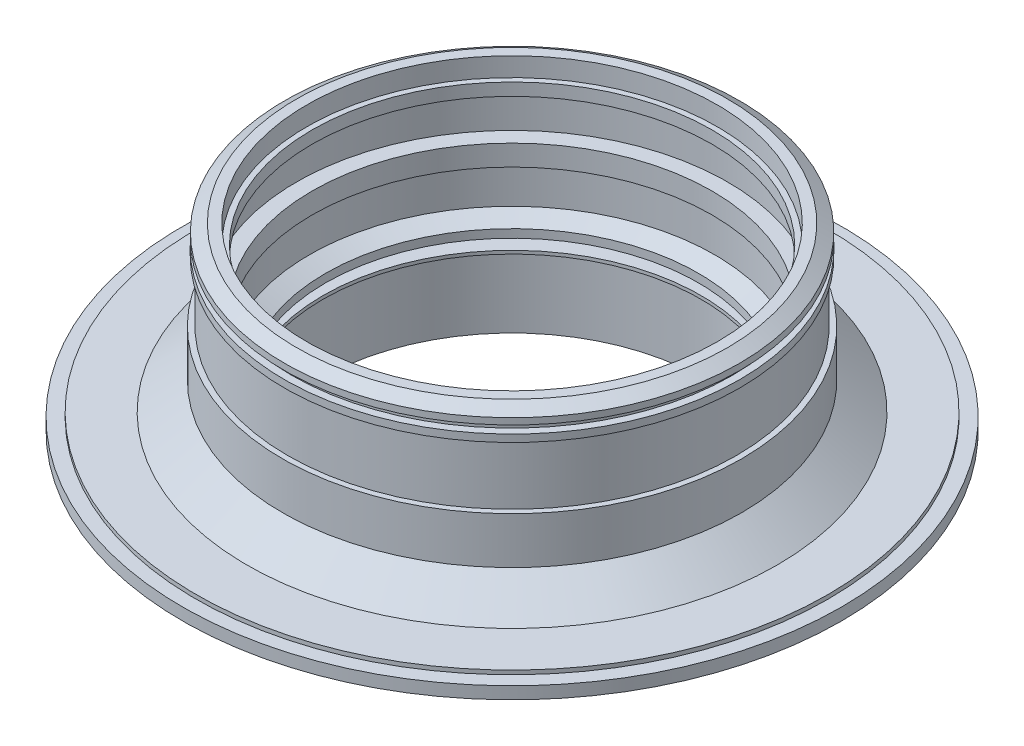
ISO-10303-21;
HEADER;
FILE_DESCRIPTION(('STEP AP214'),'2;1');
FILE_NAME('part.step','',(''),(''),'','','');
FILE_SCHEMA(('AUTOMOTIVE_DESIGN { 1 0 10303 214 1 1 1 1 }'));
ENDSEC;
DATA;
#1=APPLICATION_CONTEXT('core data for automotive mechanical design processes');
#2=APPLICATION_PROTOCOL_DEFINITION('international standard','automotive_design',2000,#1);
#3=PRODUCT_CONTEXT('',#1,'mechanical');
#4=PRODUCT('Part','Part','',(#3));
#5=PRODUCT_RELATED_PRODUCT_CATEGORY('part','',(#4));
#6=PRODUCT_DEFINITION_FORMATION('','',#4);
#7=PRODUCT_DEFINITION_CONTEXT('part definition',#1,'design');
#8=PRODUCT_DEFINITION('design','',#6,#7);
#9=PRODUCT_DEFINITION_SHAPE('','',#8);
#10=(LENGTH_UNIT() NAMED_UNIT(*) SI_UNIT(.MILLI.,.METRE.));
#11=(NAMED_UNIT(*) PLANE_ANGLE_UNIT() SI_UNIT($,.RADIAN.));
#12=(NAMED_UNIT(*) SI_UNIT($,.STERADIAN.) SOLID_ANGLE_UNIT());
#13=UNCERTAINTY_MEASURE_WITH_UNIT(LENGTH_MEASURE(1.E-05),#10,'distance_accuracy_value','');
#14=(GEOMETRIC_REPRESENTATION_CONTEXT(3) GLOBAL_UNCERTAINTY_ASSIGNED_CONTEXT((#13)) GLOBAL_UNIT_ASSIGNED_CONTEXT((#10,
#11,#12)) REPRESENTATION_CONTEXT('',''));
#15=CARTESIAN_POINT('',(0.,0.,0.));
#16=DIRECTION('',(0.,0.,1.));
#17=DIRECTION('',(1.,0.,0.));
#18=AXIS2_PLACEMENT_3D('',#15,#16,#17);
#19=CARTESIAN_POINT('',(0.,10.2104365016438,0.));
#20=DIRECTION('',(0.,-1.,0.));
#21=DIRECTION('',(1.,0.,0.));
#22=AXIS2_PLACEMENT_3D('',#19,#20,#21);
#23=CONICAL_SURFACE('',#22,85.,0.910291157041138);
#24=CARTESIAN_POINT('',(0.,3.36536354339501E-13,0.));
#25=DIRECTION('',(0.,-1.,0.));
#26=DIRECTION('',(1.,0.,0.));
#27=AXIS2_PLACEMENT_3D('',#24,#25,#26);
#28=CIRCLE('',#27,98.1422879736447);
#29=CARTESIAN_POINT('',(98.1422879736447,6.73188839409454E-13,0.));
#30=VERTEX_POINT('',#29);
#31=EDGE_CURVE('E10',#30,#30,#28,.T.);
#32=ORIENTED_EDGE('',*,*,#31,.F.);
#33=EDGE_LOOP('',(#32));
#34=FACE_BOUND('',#33,.T.);
#35=CARTESIAN_POINT('',(0.,10.2104365016438,0.));
#36=DIRECTION('',(0.,-1.,0.));
#37=DIRECTION('',(1.,0.,0.));
#38=AXIS2_PLACEMENT_3D('',#35,#36,#37);
#39=CIRCLE('',#38,85.);
#40=CARTESIAN_POINT('',(84.9999999999999,10.2104365016441,0.));
#41=VERTEX_POINT('',#40);
#42=EDGE_CURVE('E170',#41,#41,#39,.T.);
#43=ORIENTED_EDGE('',*,*,#42,.T.);
#44=EDGE_LOOP('',(#43));
#45=FACE_BOUND('',#44,.T.);
#46=ADVANCED_FACE('F37',(#34,#45),#23,.T.);
#47=CARTESIAN_POINT('',(-117.,0.,0.));
#48=DIRECTION('',(0.,-1.,0.));
#49=DIRECTION('',(1.,0.,0.));
#50=AXIS2_PLACEMENT_3D('',#47,#48,#49);
#51=PLANE('',#50);
#52=CARTESIAN_POINT('',(0.,4.02455846426619E-13,0.));
#53=DIRECTION('',(0.,-1.,0.));
#54=DIRECTION('',(1.,0.,0.));
#55=AXIS2_PLACEMENT_3D('',#52,#53,#54);
#56=CIRCLE('',#55,117.);
#57=CARTESIAN_POINT('',(117.,8.03794979296254E-13,0.));
#58=VERTEX_POINT('',#57);
#59=EDGE_CURVE('E43',#58,#58,#56,.T.);
#60=ORIENTED_EDGE('',*,*,#59,.F.);
#61=EDGE_LOOP('',(#60));
#62=FACE_BOUND('',#61,.T.);
#63=ORIENTED_EDGE('',*,*,#31,.T.);
#64=EDGE_LOOP('',(#63));
#65=FACE_BOUND('',#64,.T.);
#66=ADVANCED_FACE('F417',(#62,#65),#51,.F.);
#67=CARTESIAN_POINT('',(0.,-27.7680104879554,0.));
#68=DIRECTION('',(0.,-1.,0.));
#69=DIRECTION('',(1.,0.,0.));
#70=AXIS2_PLACEMENT_3D('',#67,#68,#69);
#71=CYLINDRICAL_SURFACE('',#70,117.);
#72=CARTESIAN_POINT('',(0.,-1.4999999999996,0.));
#73=DIRECTION('',(0.,-1.,0.));
#74=DIRECTION('',(1.,0.,0.));
#75=AXIS2_PLACEMENT_3D('',#72,#73,#74);
#76=CIRCLE('',#75,117.);
#77=CARTESIAN_POINT('',(117.,-1.4999999999992,0.));
#78=VERTEX_POINT('',#77);
#79=EDGE_CURVE('E47',#78,#78,#76,.T.);
#80=ORIENTED_EDGE('',*,*,#79,.F.);
#81=EDGE_LOOP('',(#80));
#82=FACE_BOUND('',#81,.T.);
#83=ORIENTED_EDGE('',*,*,#59,.T.);
#84=EDGE_LOOP('',(#83));
#85=FACE_BOUND('',#84,.T.);
#86=ADVANCED_FACE('F412',(#82,#85),#71,.T.);
#87=CARTESIAN_POINT('',(-122.,-1.50000000000001,0.));
#88=DIRECTION('',(0.,-1.,0.));
#89=DIRECTION('',(1.,0.,0.));
#90=AXIS2_PLACEMENT_3D('',#87,#88,#89);
#91=PLANE('',#90);
#92=CARTESIAN_POINT('',(0.,-1.49999999999958,0.));
#93=DIRECTION('',(0.,-1.,0.));
#94=DIRECTION('',(1.,0.,0.));
#95=AXIS2_PLACEMENT_3D('',#92,#93,#94);
#96=CIRCLE('',#95,122.);
#97=CARTESIAN_POINT('',(122.,-1.49999999999916,0.));
#98=VERTEX_POINT('',#97);
#99=EDGE_CURVE('E51',#98,#98,#96,.T.);
#100=ORIENTED_EDGE('',*,*,#99,.F.);
#101=EDGE_LOOP('',(#100));
#102=FACE_BOUND('',#101,.T.);
#103=ORIENTED_EDGE('',*,*,#79,.T.);
#104=EDGE_LOOP('',(#103));
#105=FACE_BOUND('',#104,.T.);
#106=ADVANCED_FACE('F406',(#102,#105),#91,.F.);
#107=CARTESIAN_POINT('',(0.,-27.7680104879554,0.));
#108=DIRECTION('',(0.,-1.,0.));
#109=DIRECTION('',(1.,0.,0.));
#110=AXIS2_PLACEMENT_3D('',#107,#108,#109);
#111=CYLINDRICAL_SURFACE('',#110,122.);
#112=CARTESIAN_POINT('',(0.,-5.99999999999959,0.));
#113=DIRECTION('',(0.,-1.,0.));
#114=DIRECTION('',(1.,0.,0.));
#115=AXIS2_PLACEMENT_3D('',#112,#113,#114);
#116=CIRCLE('',#115,122.);
#117=CARTESIAN_POINT('',(122.,-5.99999999999917,0.));
#118=VERTEX_POINT('',#117);
#119=EDGE_CURVE('E56',#118,#118,#116,.T.);
#120=ORIENTED_EDGE('',*,*,#119,.F.);
#121=EDGE_LOOP('',(#120));
#122=FACE_BOUND('',#121,.T.);
#123=ORIENTED_EDGE('',*,*,#99,.T.);
#124=EDGE_LOOP('',(#123));
#125=FACE_BOUND('',#124,.T.);
#126=ADVANCED_FACE('F400',(#122,#125),#111,.T.);
#127=CARTESIAN_POINT('',(-93.5,-5.99999999999996,0.));
#128=DIRECTION('',(0.,1.,0.));
#129=DIRECTION('',(-1.,0.,0.));
#130=AXIS2_PLACEMENT_3D('',#127,#128,#129);
#131=PLANE('',#130);
#132=CARTESIAN_POINT('',(0.,-5.99999999999968,0.));
#133=DIRECTION('',(0.,-1.,0.));
#134=DIRECTION('',(1.,0.,0.));
#135=AXIS2_PLACEMENT_3D('',#132,#133,#134);
#136=CIRCLE('',#135,93.5);
#137=CARTESIAN_POINT('',(93.5,-5.99999999999936,0.));
#138=VERTEX_POINT('',#137);
#139=EDGE_CURVE('E59',#138,#138,#136,.T.);
#140=ORIENTED_EDGE('',*,*,#139,.F.);
#141=EDGE_LOOP('',(#140));
#142=FACE_BOUND('',#141,.T.);
#143=ORIENTED_EDGE('',*,*,#119,.T.);
#144=EDGE_LOOP('',(#143));
#145=FACE_BOUND('',#144,.T.);
#146=ADVANCED_FACE('F394',(#142,#145),#131,.F.);
#147=CARTESIAN_POINT('',(0.,-27.7680104879554,0.));
#148=DIRECTION('',(0.,-1.,0.));
#149=DIRECTION('',(1.,0.,0.));
#150=AXIS2_PLACEMENT_3D('',#147,#148,#149);
#151=CYLINDRICAL_SURFACE('',#150,93.5);
#152=CARTESIAN_POINT('',(0.,-11.9999999999997,0.));
#153=DIRECTION('',(0.,-1.,0.));
#154=DIRECTION('',(1.,0.,0.));
#155=AXIS2_PLACEMENT_3D('',#152,#153,#154);
#156=CIRCLE('',#155,93.5);
#157=CARTESIAN_POINT('',(93.5000000000001,-11.9999999999994,0.));
#158=VERTEX_POINT('',#157);
#159=EDGE_CURVE('E62',#158,#158,#156,.T.);
#160=ORIENTED_EDGE('',*,*,#159,.F.);
#161=EDGE_LOOP('',(#160));
#162=FACE_BOUND('',#161,.T.);
#163=ORIENTED_EDGE('',*,*,#139,.T.);
#164=EDGE_LOOP('',(#163));
#165=FACE_BOUND('',#164,.T.);
#166=ADVANCED_FACE('F388',(#162,#165),#151,.T.);
#167=CARTESIAN_POINT('',(-87.5,-12.,0.));
#168=DIRECTION('',(0.,1.,0.));
#169=DIRECTION('',(-1.,0.,0.));
#170=AXIS2_PLACEMENT_3D('',#167,#168,#169);
#171=PLANE('',#170);
#172=CARTESIAN_POINT('',(0.,-11.9999999999997,0.));
#173=DIRECTION('',(0.,-1.,0.));
#174=DIRECTION('',(1.,0.,0.));
#175=AXIS2_PLACEMENT_3D('',#172,#173,#174);
#176=CIRCLE('',#175,87.5);
#177=CARTESIAN_POINT('',(87.5000000000001,-11.9999999999994,0.));
#178=VERTEX_POINT('',#177);
#179=EDGE_CURVE('E65',#178,#178,#176,.T.);
#180=ORIENTED_EDGE('',*,*,#179,.F.);
#181=EDGE_LOOP('',(#180));
#182=FACE_BOUND('',#181,.T.);
#183=ORIENTED_EDGE('',*,*,#159,.T.);
#184=EDGE_LOOP('',(#183));
#185=FACE_BOUND('',#184,.T.);
#186=ADVANCED_FACE('F382',(#182,#185),#171,.F.);
#187=CARTESIAN_POINT('',(0.,-27.7680104879554,0.));
#188=DIRECTION('',(0.,-1.,0.));
#189=DIRECTION('',(1.,0.,0.));
#190=AXIS2_PLACEMENT_3D('',#187,#188,#189);
#191=CYLINDRICAL_SURFACE('',#190,87.5);
#192=CARTESIAN_POINT('',(0.,-9.27760828845824,0.));
#193=DIRECTION('',(0.,-1.,0.));
#194=DIRECTION('',(1.,0.,0.));
#195=AXIS2_PLACEMENT_3D('',#192,#193,#194);
#196=CIRCLE('',#195,87.5);
#197=CARTESIAN_POINT('',(87.5000000000001,-9.27760828845794,0.));
#198=VERTEX_POINT('',#197);
#199=EDGE_CURVE('E68',#198,#198,#196,.T.);
#200=ORIENTED_EDGE('',*,*,#199,.F.);
#201=EDGE_LOOP('',(#200));
#202=FACE_BOUND('',#201,.T.);
#203=ORIENTED_EDGE('',*,*,#179,.T.);
#204=EDGE_LOOP('',(#203));
#205=FACE_BOUND('',#204,.T.);
#206=ADVANCED_FACE('F376',(#202,#205),#191,.F.);
#207=CARTESIAN_POINT('',(0.,-9.27760828845824,0.));
#208=DIRECTION('',(0.,-1.,0.));
#209=DIRECTION('',(1.,0.,0.));
#210=AXIS2_PLACEMENT_3D('',#207,#208,#209);
#211=CONICAL_SURFACE('',#210,87.5,0.802099702410123);
#212=CARTESIAN_POINT('',(0.,-2.64999999999972,0.));
#213=DIRECTION('',(0.,-1.,0.));
#214=DIRECTION('',(1.,0.,0.));
#215=AXIS2_PLACEMENT_3D('',#212,#213,#214);
#216=CIRCLE('',#215,80.6472276725317);
#217=CARTESIAN_POINT('',(80.6472276725317,-2.64999999999945,0.));
#218=VERTEX_POINT('',#217);
#219=EDGE_CURVE('E71',#218,#218,#216,.T.);
#220=ORIENTED_EDGE('',*,*,#219,.F.);
#221=EDGE_LOOP('',(#220));
#222=FACE_BOUND('',#221,.T.);
#223=ORIENTED_EDGE('',*,*,#199,.T.);
#224=EDGE_LOOP('',(#223));
#225=FACE_BOUND('',#224,.T.);
#226=ADVANCED_FACE('F370',(#222,#225),#211,.F.);
#227=CARTESIAN_POINT('',(-74.5,-2.64999999999999,0.));
#228=DIRECTION('',(0.,1.,0.));
#229=DIRECTION('',(-1.,0.,0.));
#230=AXIS2_PLACEMENT_3D('',#227,#228,#229);
#231=PLANE('',#230);
#232=CARTESIAN_POINT('',(0.,-2.64999999999974,0.));
#233=DIRECTION('',(0.,-1.,0.));
#234=DIRECTION('',(1.,0.,0.));
#235=AXIS2_PLACEMENT_3D('',#232,#233,#234);
#236=CIRCLE('',#235,74.5);
#237=CARTESIAN_POINT('',(74.5,-2.64999999999949,0.));
#238=VERTEX_POINT('',#237);
#239=EDGE_CURVE('E74',#238,#238,#236,.T.);
#240=ORIENTED_EDGE('',*,*,#239,.F.);
#241=EDGE_LOOP('',(#240));
#242=FACE_BOUND('',#241,.T.);
#243=ORIENTED_EDGE('',*,*,#219,.T.);
#244=EDGE_LOOP('',(#243));
#245=FACE_BOUND('',#244,.T.);
#246=ADVANCED_FACE('F364',(#242,#245),#231,.F.);
#247=CARTESIAN_POINT('',(0.,-27.7680104879554,0.));
#248=DIRECTION('',(0.,-1.,0.));
#249=DIRECTION('',(1.,0.,0.));
#250=AXIS2_PLACEMENT_3D('',#247,#248,#249);
#251=CYLINDRICAL_SURFACE('',#250,74.5);
#252=CARTESIAN_POINT('',(0.,-17.3797404508596,0.));
#253=DIRECTION('',(0.,-1.,0.));
#254=DIRECTION('',(1.,0.,0.));
#255=AXIS2_PLACEMENT_3D('',#252,#253,#254);
#256=CIRCLE('',#255,74.5000000000001);
#257=CARTESIAN_POINT('',(74.5000000000001,-17.3797404508593,0.));
#258=VERTEX_POINT('',#257);
#259=EDGE_CURVE('E77',#258,#258,#256,.T.);
#260=ORIENTED_EDGE('',*,*,#259,.F.);
#261=EDGE_LOOP('',(#260));
#262=FACE_BOUND('',#261,.T.);
#263=ORIENTED_EDGE('',*,*,#239,.T.);
#264=EDGE_LOOP('',(#263));
#265=FACE_BOUND('',#264,.T.);
#266=ADVANCED_FACE('F358',(#262,#265),#251,.T.);
#267=CARTESIAN_POINT('',(-77.75,-17.3797404508598,0.));
#268=DIRECTION('',(0.,-1.,0.));
#269=DIRECTION('',(1.,0.,0.));
#270=AXIS2_PLACEMENT_3D('',#267,#268,#269);
#271=PLANE('',#270);
#272=CARTESIAN_POINT('',(0.,-17.3797404508595,0.));
#273=DIRECTION('',(0.,-1.,0.));
#274=DIRECTION('',(1.,0.,0.));
#275=AXIS2_PLACEMENT_3D('',#272,#273,#274);
#276=CIRCLE('',#275,77.7500000000001);
#277=CARTESIAN_POINT('',(77.7500000000001,-17.3797404508593,0.));
#278=VERTEX_POINT('',#277);
#279=EDGE_CURVE('E80',#278,#278,#276,.T.);
#280=ORIENTED_EDGE('',*,*,#279,.F.);
#281=EDGE_LOOP('',(#280));
#282=FACE_BOUND('',#281,.T.);
#283=ORIENTED_EDGE('',*,*,#259,.T.);
#284=EDGE_LOOP('',(#283));
#285=FACE_BOUND('',#284,.T.);
#286=ADVANCED_FACE('F352',(#282,#285),#271,.F.);
#287=CARTESIAN_POINT('',(0.,-27.7680104879554,0.));
#288=DIRECTION('',(0.,-1.,0.));
#289=DIRECTION('',(1.,0.,0.));
#290=AXIS2_PLACEMENT_3D('',#287,#288,#289);
#291=CYLINDRICAL_SURFACE('',#290,77.7500000000001);
#292=CARTESIAN_POINT('',(0.,-24.8797404508595,0.));
#293=DIRECTION('',(0.,-1.,0.));
#294=DIRECTION('',(1.,0.,0.));
#295=AXIS2_PLACEMENT_3D('',#292,#293,#294);
#296=CIRCLE('',#295,77.7500000000001);
#297=CARTESIAN_POINT('',(77.7500000000002,-24.8797404508593,0.));
#298=VERTEX_POINT('',#297);
#299=EDGE_CURVE('E83',#298,#298,#296,.T.);
#300=ORIENTED_EDGE('',*,*,#299,.F.);
#301=EDGE_LOOP('',(#300));
#302=FACE_BOUND('',#301,.T.);
#303=ORIENTED_EDGE('',*,*,#279,.T.);
#304=EDGE_LOOP('',(#303));
#305=FACE_BOUND('',#304,.T.);
#306=ADVANCED_FACE('F346',(#302,#305),#291,.T.);
#307=CARTESIAN_POINT('',(-71.,-24.8797404508598,0.));
#308=DIRECTION('',(0.,1.,0.));
#309=DIRECTION('',(-1.,0.,0.));
#310=AXIS2_PLACEMENT_3D('',#307,#308,#309);
#311=PLANE('',#310);
#312=CARTESIAN_POINT('',(0.,-24.8797404508596,0.));
#313=DIRECTION('',(0.,-1.,0.));
#314=DIRECTION('',(1.,0.,0.));
#315=AXIS2_PLACEMENT_3D('',#312,#313,#314);
#316=CIRCLE('',#315,71.0000000000001);
#317=CARTESIAN_POINT('',(71.0000000000002,-24.8797404508593,0.));
#318=VERTEX_POINT('',#317);
#319=EDGE_CURVE('E86',#318,#318,#316,.T.);
#320=ORIENTED_EDGE('',*,*,#319,.F.);
#321=EDGE_LOOP('',(#320));
#322=FACE_BOUND('',#321,.T.);
#323=ORIENTED_EDGE('',*,*,#299,.T.);
#324=EDGE_LOOP('',(#323));
#325=FACE_BOUND('',#324,.T.);
#326=ADVANCED_FACE('F340',(#322,#325),#311,.F.);
#327=CARTESIAN_POINT('',(0.,-27.7680104879554,0.));
#328=DIRECTION('',(0.,-1.,0.));
#329=DIRECTION('',(1.,0.,0.));
#330=AXIS2_PLACEMENT_3D('',#327,#328,#329);
#331=CYLINDRICAL_SURFACE('',#330,71.);
#332=CARTESIAN_POINT('',(0.,1.14472704675852,0.));
#333=DIRECTION('',(0.,-1.,0.));
#334=DIRECTION('',(1.,0.,0.));
#335=AXIS2_PLACEMENT_3D('',#332,#333,#334);
#336=CIRCLE('',#335,71.);
#337=CARTESIAN_POINT('',(71.,1.14472704675876,0.));
#338=VERTEX_POINT('',#337);
#339=EDGE_CURVE('E89',#338,#338,#336,.T.);
#340=ORIENTED_EDGE('',*,*,#339,.F.);
#341=EDGE_LOOP('',(#340));
#342=FACE_BOUND('',#341,.T.);
#343=ORIENTED_EDGE('',*,*,#319,.T.);
#344=EDGE_LOOP('',(#343));
#345=FACE_BOUND('',#344,.T.);
#346=ADVANCED_FACE('F334',(#342,#345),#331,.F.);
#347=CARTESIAN_POINT('',(-70.,1.14472704675828,0.));
#348=DIRECTION('',(0.,1.,0.));
#349=DIRECTION('',(-1.,0.,0.));
#350=AXIS2_PLACEMENT_3D('',#347,#348,#349);
#351=PLANE('',#350);
#352=CARTESIAN_POINT('',(0.,1.14472704675852,0.));
#353=DIRECTION('',(0.,-1.,0.));
#354=DIRECTION('',(1.,0.,0.));
#355=AXIS2_PLACEMENT_3D('',#352,#353,#354);
#356=CIRCLE('',#355,70.);
#357=CARTESIAN_POINT('',(70.,1.14472704675876,0.));
#358=VERTEX_POINT('',#357);
#359=EDGE_CURVE('E92',#358,#358,#356,.T.);
#360=ORIENTED_EDGE('',*,*,#359,.F.);
#361=EDGE_LOOP('',(#360));
#362=FACE_BOUND('',#361,.T.);
#363=ORIENTED_EDGE('',*,*,#339,.T.);
#364=EDGE_LOOP('',(#363));
#365=FACE_BOUND('',#364,.T.);
#366=ADVANCED_FACE('F328',(#362,#365),#351,.F.);
#367=CARTESIAN_POINT('',(0.,-27.7680104879554,0.));
#368=DIRECTION('',(0.,-1.,0.));
#369=DIRECTION('',(1.,0.,0.));
#370=AXIS2_PLACEMENT_3D('',#367,#368,#369);
#371=CYLINDRICAL_SURFACE('',#370,70.);
#372=CARTESIAN_POINT('',(0.,2.34472704675852,0.));
#373=DIRECTION('',(0.,-1.,0.));
#374=DIRECTION('',(1.,0.,0.));
#375=AXIS2_PLACEMENT_3D('',#372,#373,#374);
#376=CIRCLE('',#375,70.);
#377=CARTESIAN_POINT('',(70.,2.34472704675876,0.));
#378=VERTEX_POINT('',#377);
#379=EDGE_CURVE('E95',#378,#378,#376,.T.);
#380=ORIENTED_EDGE('',*,*,#379,.F.);
#381=EDGE_LOOP('',(#380));
#382=FACE_BOUND('',#381,.T.);
#383=ORIENTED_EDGE('',*,*,#359,.T.);
#384=EDGE_LOOP('',(#383));
#385=FACE_BOUND('',#384,.T.);
#386=ADVANCED_FACE('F322',(#382,#385),#371,.F.);
#387=CARTESIAN_POINT('',(-75.8188130894523,2.34472704675827,0.));
#388=DIRECTION('',(0.,-1.,0.));
#389=DIRECTION('',(1.,0.,0.));
#390=AXIS2_PLACEMENT_3D('',#387,#388,#389);
#391=PLANE('',#390);
#392=CARTESIAN_POINT('',(0.,2.34472704675854,0.));
#393=DIRECTION('',(0.,-1.,0.));
#394=DIRECTION('',(1.,0.,0.));
#395=AXIS2_PLACEMENT_3D('',#392,#393,#394);
#396=CIRCLE('',#395,75.8188130894523);
#397=CARTESIAN_POINT('',(75.8188130894523,2.3447270467588,0.));
#398=VERTEX_POINT('',#397);
#399=EDGE_CURVE('E98',#398,#398,#396,.T.);
#400=ORIENTED_EDGE('',*,*,#399,.F.);
#401=EDGE_LOOP('',(#400));
#402=FACE_BOUND('',#401,.T.);
#403=ORIENTED_EDGE('',*,*,#379,.T.);
#404=EDGE_LOOP('',(#403));
#405=FACE_BOUND('',#404,.T.);
#406=ADVANCED_FACE('F316',(#402,#405),#391,.F.);
#407=CARTESIAN_POINT('',(0.,-27.7680104879554,0.));
#408=DIRECTION('',(0.,-1.,0.));
#409=DIRECTION('',(1.,0.,0.));
#410=AXIS2_PLACEMENT_3D('',#407,#408,#409);
#411=CYLINDRICAL_SURFACE('',#410,75.8188130894523);
#412=CARTESIAN_POINT('',(0.,4.44783301625511,0.));
#413=DIRECTION('',(0.,-1.,0.));
#414=DIRECTION('',(1.,0.,0.));
#415=AXIS2_PLACEMENT_3D('',#412,#413,#414);
#416=CIRCLE('',#415,75.8188130894523);
#417=CARTESIAN_POINT('',(75.8188130894522,4.44783301625537,0.));
#418=VERTEX_POINT('',#417);
#419=EDGE_CURVE('E101',#418,#418,#416,.T.);
#420=ORIENTED_EDGE('',*,*,#419,.F.);
#421=EDGE_LOOP('',(#420));
#422=FACE_BOUND('',#421,.T.);
#423=ORIENTED_EDGE('',*,*,#399,.T.);
#424=EDGE_LOOP('',(#423));
#425=FACE_BOUND('',#424,.T.);
#426=ADVANCED_FACE('F310',(#422,#425),#411,.F.);
#427=CARTESIAN_POINT('',(0.,4.44783301625511,0.));
#428=DIRECTION('',(0.,-1.,0.));
#429=DIRECTION('',(1.,0.,0.));
#430=AXIS2_PLACEMENT_3D('',#427,#428,#429);
#431=CONICAL_SURFACE('',#430,75.8188130894523,1.22173047639604);
#432=CARTESIAN_POINT('',(0.,6.92967801384045,0.));
#433=DIRECTION('',(0.,-1.,0.));
#434=DIRECTION('',(1.,0.,0.));
#435=AXIS2_PLACEMENT_3D('',#432,#433,#434);
#436=CIRCLE('',#435,69.);
#437=CARTESIAN_POINT('',(68.9999999999999,6.92967801384069,0.));
#438=VERTEX_POINT('',#437);
#439=EDGE_CURVE('E104',#438,#438,#436,.T.);
#440=ORIENTED_EDGE('',*,*,#439,.F.);
#441=EDGE_LOOP('',(#440));
#442=FACE_BOUND('',#441,.T.);
#443=ORIENTED_EDGE('',*,*,#419,.T.);
#444=EDGE_LOOP('',(#443));
#445=FACE_BOUND('',#444,.T.);
#446=ADVANCED_FACE('F304',(#442,#445),#431,.F.);
#447=CARTESIAN_POINT('',(0.,-27.7680104879554,0.));
#448=DIRECTION('',(0.,-1.,0.));
#449=DIRECTION('',(1.,0.,0.));
#450=AXIS2_PLACEMENT_3D('',#447,#448,#449);
#451=CYLINDRICAL_SURFACE('',#450,69.);
#452=CARTESIAN_POINT('',(0.,10.0009265007206,0.));
#453=DIRECTION('',(0.,-1.,0.));
#454=DIRECTION('',(1.,0.,0.));
#455=AXIS2_PLACEMENT_3D('',#452,#453,#454);
#456=CIRCLE('',#455,69.);
#457=CARTESIAN_POINT('',(68.9999999999999,10.0009265007208,0.));
#458=VERTEX_POINT('',#457);
#459=EDGE_CURVE('E107',#458,#458,#456,.T.);
#460=ORIENTED_EDGE('',*,*,#459,.F.);
#461=EDGE_LOOP('',(#460));
#462=FACE_BOUND('',#461,.T.);
#463=ORIENTED_EDGE('',*,*,#439,.T.);
#464=EDGE_LOOP('',(#463));
#465=FACE_BOUND('',#464,.T.);
#466=ADVANCED_FACE('F298',(#462,#465),#451,.F.);
#467=CARTESIAN_POINT('',(0.,10.0009265007206,0.));
#468=DIRECTION('',(0.,1.,0.));
#469=DIRECTION('',(-1.,0.,0.));
#470=AXIS2_PLACEMENT_3D('',#467,#468,#469);
#471=CONICAL_SURFACE('',#470,69.,1.1159165690341);
#472=CARTESIAN_POINT('',(0.,12.9354529697379,0.));
#473=DIRECTION('',(0.,-1.,0.));
#474=DIRECTION('',(1.,0.,0.));
#475=AXIS2_PLACEMENT_3D('',#472,#473,#474);
#476=CIRCLE('',#475,75.);
#477=CARTESIAN_POINT('',(74.9999999999999,12.9354529697382,0.));
#478=VERTEX_POINT('',#477);
#479=EDGE_CURVE('E110',#478,#478,#476,.T.);
#480=ORIENTED_EDGE('',*,*,#479,.F.);
#481=EDGE_LOOP('',(#480));
#482=FACE_BOUND('',#481,.T.);
#483=ORIENTED_EDGE('',*,*,#459,.T.);
#484=EDGE_LOOP('',(#483));
#485=FACE_BOUND('',#484,.T.);
#486=ADVANCED_FACE('F292',(#482,#485),#471,.F.);
#487=CARTESIAN_POINT('',(0.,-27.7680104879554,0.));
#488=DIRECTION('',(0.,-1.,0.));
#489=DIRECTION('',(1.,0.,0.));
#490=AXIS2_PLACEMENT_3D('',#487,#488,#489);
#491=CYLINDRICAL_SURFACE('',#490,74.9999999999999);
#492=CARTESIAN_POINT('',(0.,26.2044825279115,0.));
#493=DIRECTION('',(0.,-1.,0.));
#494=DIRECTION('',(1.,0.,0.));
#495=AXIS2_PLACEMENT_3D('',#492,#493,#494);
#496=CIRCLE('',#495,74.9999999999999);
#497=CARTESIAN_POINT('',(74.9999999999998,26.2044825279118,0.));
#498=VERTEX_POINT('',#497);
#499=EDGE_CURVE('E113',#498,#498,#496,.T.);
#500=ORIENTED_EDGE('',*,*,#499,.F.);
#501=EDGE_LOOP('',(#500));
#502=FACE_BOUND('',#501,.T.);
#503=ORIENTED_EDGE('',*,*,#479,.T.);
#504=EDGE_LOOP('',(#503));
#505=FACE_BOUND('',#504,.T.);
#506=ADVANCED_FACE('F286',(#502,#505),#491,.F.);
#507=CARTESIAN_POINT('',(-74.,26.2044825279112,0.));
#508=DIRECTION('',(0.,1.,0.));
#509=DIRECTION('',(-1.,0.,0.));
#510=AXIS2_PLACEMENT_3D('',#507,#508,#509);
#511=PLANE('',#510);
#512=CARTESIAN_POINT('',(0.,26.2044825279115,0.));
#513=DIRECTION('',(0.,-1.,0.));
#514=DIRECTION('',(1.,0.,0.));
#515=AXIS2_PLACEMENT_3D('',#512,#513,#514);
#516=CIRCLE('',#515,73.9999999999999);
#517=CARTESIAN_POINT('',(73.9999999999998,26.2044825279118,0.));
#518=VERTEX_POINT('',#517);
#519=EDGE_CURVE('E116',#518,#518,#516,.T.);
#520=ORIENTED_EDGE('',*,*,#519,.F.);
#521=EDGE_LOOP('',(#520));
#522=FACE_BOUND('',#521,.T.);
#523=ORIENTED_EDGE('',*,*,#499,.T.);
#524=EDGE_LOOP('',(#523));
#525=FACE_BOUND('',#524,.T.);
#526=ADVANCED_FACE('F280',(#522,#525),#511,.F.);
#527=CARTESIAN_POINT('',(0.,-27.7680104879554,0.));
#528=DIRECTION('',(0.,-1.,0.));
#529=DIRECTION('',(1.,0.,0.));
#530=AXIS2_PLACEMENT_3D('',#527,#528,#529);
#531=CYLINDRICAL_SURFACE('',#530,73.9999999999999);
#532=CARTESIAN_POINT('',(-1.162324746909E-13,33.8845590301623,0.));
#533=DIRECTION('',(0.,-1.,0.));
#534=DIRECTION('',(1.,0.,0.));
#535=AXIS2_PLACEMENT_3D('',#532,#533,#534);
#536=CIRCLE('',#535,73.9999999999999);
#537=CARTESIAN_POINT('',(73.9999999999998,33.8845590301625,0.));
#538=VERTEX_POINT('',#537);
#539=EDGE_CURVE('E119',#538,#538,#536,.T.);
#540=ORIENTED_EDGE('',*,*,#539,.F.);
#541=EDGE_LOOP('',(#540));
#542=FACE_BOUND('',#541,.T.);
#543=ORIENTED_EDGE('',*,*,#519,.T.);
#544=EDGE_LOOP('',(#543));
#545=FACE_BOUND('',#544,.T.);
#546=ADVANCED_FACE('F274',(#542,#545),#531,.F.);
#547=CARTESIAN_POINT('',(-79.7682056730505,33.884559030162,0.));
#548=DIRECTION('',(0.,-1.,0.));
#549=DIRECTION('',(1.,0.,0.));
#550=AXIS2_PLACEMENT_3D('',#547,#548,#549);
#551=PLANE('',#550);
#552=CARTESIAN_POINT('',(-1.162324746909E-13,33.8845590301623,0.));
#553=DIRECTION('',(0.,-1.,0.));
#554=DIRECTION('',(1.,0.,0.));
#555=AXIS2_PLACEMENT_3D('',#552,#553,#554);
#556=CIRCLE('',#555,79.7682056730504);
#557=CARTESIAN_POINT('',(79.7682056730503,33.8845590301625,0.));
#558=VERTEX_POINT('',#557);
#559=EDGE_CURVE('E122',#558,#558,#556,.T.);
#560=ORIENTED_EDGE('',*,*,#559,.F.);
#561=EDGE_LOOP('',(#560));
#562=FACE_BOUND('',#561,.T.);
#563=ORIENTED_EDGE('',*,*,#539,.T.);
#564=EDGE_LOOP('',(#563));
#565=FACE_BOUND('',#564,.T.);
#566=ADVANCED_FACE('F268',(#562,#565),#551,.F.);
#567=CARTESIAN_POINT('',(0.,-27.7680104879554,0.));
#568=DIRECTION('',(0.,-1.,0.));
#569=DIRECTION('',(1.,0.,0.));
#570=AXIS2_PLACEMENT_3D('',#567,#568,#569);
#571=CYLINDRICAL_SURFACE('',#570,79.7682056730504);
#572=CARTESIAN_POINT('',(-1.67686209674186E-13,48.8845590301623,0.));
#573=DIRECTION('',(0.,-1.,0.));
#574=DIRECTION('',(1.,0.,0.));
#575=AXIS2_PLACEMENT_3D('',#572,#573,#574);
#576=CIRCLE('',#575,79.7682056730504);
#577=CARTESIAN_POINT('',(79.7682056730502,48.8845590301625,0.));
#578=VERTEX_POINT('',#577);
#579=EDGE_CURVE('E125',#578,#578,#576,.T.);
#580=ORIENTED_EDGE('',*,*,#579,.F.);
#581=EDGE_LOOP('',(#580));
#582=FACE_BOUND('',#581,.T.);
#583=ORIENTED_EDGE('',*,*,#559,.T.);
#584=EDGE_LOOP('',(#583));
#585=FACE_BOUND('',#584,.T.);
#586=ADVANCED_FACE('F262',(#582,#585),#571,.F.);
#587=CARTESIAN_POINT('',(-74.,48.884559030162,0.));
#588=DIRECTION('',(0.,1.,0.));
#589=DIRECTION('',(-1.,0.,0.));
#590=AXIS2_PLACEMENT_3D('',#587,#588,#589);
#591=PLANE('',#590);
#592=CARTESIAN_POINT('',(-1.67686209674186E-13,48.8845590301622,0.));
#593=DIRECTION('',(0.,-1.,0.));
#594=DIRECTION('',(1.,0.,0.));
#595=AXIS2_PLACEMENT_3D('',#592,#593,#594);
#596=CIRCLE('',#595,73.9999999999998);
#597=CARTESIAN_POINT('',(73.9999999999997,48.8845590301625,0.));
#598=VERTEX_POINT('',#597);
#599=EDGE_CURVE('E128',#598,#598,#596,.T.);
#600=ORIENTED_EDGE('',*,*,#599,.F.);
#601=EDGE_LOOP('',(#600));
#602=FACE_BOUND('',#601,.T.);
#603=ORIENTED_EDGE('',*,*,#579,.T.);
#604=EDGE_LOOP('',(#603));
#605=FACE_BOUND('',#604,.T.);
#606=ADVANCED_FACE('F256',(#602,#605),#591,.F.);
#607=CARTESIAN_POINT('',(0.,-27.7680104879554,0.));
#608=DIRECTION('',(0.,-1.,0.));
#609=DIRECTION('',(1.,0.,0.));
#610=AXIS2_PLACEMENT_3D('',#607,#608,#609);
#611=CYLINDRICAL_SURFACE('',#610,73.9999999999998);
#612=CARTESIAN_POINT('',(-1.83447193487209E-13,53.4792644926936,0.));
#613=DIRECTION('',(0.,-1.,0.));
#614=DIRECTION('',(1.,0.,0.));
#615=AXIS2_PLACEMENT_3D('',#612,#613,#614);
#616=CIRCLE('',#615,73.9999999999998);
#617=CARTESIAN_POINT('',(73.9999999999996,53.4792644926938,0.));
#618=VERTEX_POINT('',#617);
#619=EDGE_CURVE('E131',#618,#618,#616,.T.);
#620=ORIENTED_EDGE('',*,*,#619,.F.);
#621=EDGE_LOOP('',(#620));
#622=FACE_BOUND('',#621,.T.);
#623=ORIENTED_EDGE('',*,*,#599,.T.);
#624=EDGE_LOOP('',(#623));
#625=FACE_BOUND('',#624,.T.);
#626=ADVANCED_FACE('F250',(#622,#625),#611,.F.);
#627=CARTESIAN_POINT('',(-75.9792781144274,53.4792644926933,0.));
#628=DIRECTION('',(0.,-1.,0.));
#629=DIRECTION('',(1.,0.,0.));
#630=AXIS2_PLACEMENT_3D('',#627,#628,#629);
#631=PLANE('',#630);
#632=CARTESIAN_POINT('',(-1.83447193487209E-13,53.4792644926936,0.));
#633=DIRECTION('',(0.,-1.,0.));
#634=DIRECTION('',(1.,0.,0.));
#635=AXIS2_PLACEMENT_3D('',#632,#633,#634);
#636=CIRCLE('',#635,75.9792781144272);
#637=CARTESIAN_POINT('',(75.979278114427,53.4792644926938,0.));
#638=VERTEX_POINT('',#637);
#639=EDGE_CURVE('E134',#638,#638,#636,.T.);
#640=ORIENTED_EDGE('',*,*,#639,.F.);
#641=EDGE_LOOP('',(#640));
#642=FACE_BOUND('',#641,.T.);
#643=ORIENTED_EDGE('',*,*,#619,.T.);
#644=EDGE_LOOP('',(#643));
#645=FACE_BOUND('',#644,.T.);
#646=ADVANCED_FACE('F244',(#642,#645),#631,.F.);
#647=CARTESIAN_POINT('',(0.,-27.7680104879554,0.));
#648=DIRECTION('',(0.,-1.,0.));
#649=DIRECTION('',(1.,0.,0.));
#650=AXIS2_PLACEMENT_3D('',#647,#648,#649);
#651=CYLINDRICAL_SURFACE('',#650,75.9792781144272);
#652=CARTESIAN_POINT('',(-2.0753006443259E-13,60.5000000000003,0.));
#653=DIRECTION('',(0.,-1.,0.));
#654=DIRECTION('',(1.,0.,0.));
#655=AXIS2_PLACEMENT_3D('',#652,#653,#654);
#656=CIRCLE('',#655,75.9792781144271);
#657=CARTESIAN_POINT('',(75.9792781144269,60.5000000000005,0.));
#658=VERTEX_POINT('',#657);
#659=EDGE_CURVE('E137',#658,#658,#656,.T.);
#660=ORIENTED_EDGE('',*,*,#659,.F.);
#661=EDGE_LOOP('',(#660));
#662=FACE_BOUND('',#661,.T.);
#663=ORIENTED_EDGE('',*,*,#639,.T.);
#664=EDGE_LOOP('',(#663));
#665=FACE_BOUND('',#664,.T.);
#666=ADVANCED_FACE('F238',(#662,#665),#651,.F.);
#667=CARTESIAN_POINT('',(-79.7682056730505,60.5,0.));
#668=DIRECTION('',(0.,-1.,0.));
#669=DIRECTION('',(1.,0.,0.));
#670=AXIS2_PLACEMENT_3D('',#667,#668,#669);
#671=PLANE('',#670);
#672=CARTESIAN_POINT('',(-2.0753006443259E-13,60.5000000000003,0.));
#673=DIRECTION('',(0.,-1.,0.));
#674=DIRECTION('',(1.,0.,0.));
#675=AXIS2_PLACEMENT_3D('',#672,#673,#674);
#676=CIRCLE('',#675,79.7682056730503);
#677=CARTESIAN_POINT('',(79.7682056730501,60.5000000000005,0.));
#678=VERTEX_POINT('',#677);
#679=EDGE_CURVE('E140',#678,#678,#676,.T.);
#680=ORIENTED_EDGE('',*,*,#679,.F.);
#681=EDGE_LOOP('',(#680));
#682=FACE_BOUND('',#681,.T.);
#683=ORIENTED_EDGE('',*,*,#659,.T.);
#684=EDGE_LOOP('',(#683));
#685=FACE_BOUND('',#684,.T.);
#686=ADVANCED_FACE('F232',(#682,#685),#671,.F.);
#687=CARTESIAN_POINT('',(-2.0753006443259E-13,60.5000000000003,0.));
#688=DIRECTION('',(0.,-1.,0.));
#689=DIRECTION('',(1.,0.,0.));
#690=AXIS2_PLACEMENT_3D('',#687,#688,#689);
#691=CONICAL_SURFACE('',#690,79.7682056730503,1.00988124301635);
#692=CARTESIAN_POINT('',(-1.97956221682804E-13,57.7089948126523,0.));
#693=DIRECTION('',(0.,-1.,0.));
#694=DIRECTION('',(1.,0.,0.));
#695=AXIS2_PLACEMENT_3D('',#692,#693,#694);
#696=CIRCLE('',#695,84.2108894471516);
#697=CARTESIAN_POINT('',(84.2108894471514,57.7089948126526,0.));
#698=VERTEX_POINT('',#697);
#699=EDGE_CURVE('E143',#698,#698,#696,.T.);
#700=ORIENTED_EDGE('',*,*,#699,.F.);
#701=EDGE_LOOP('',(#700));
#702=FACE_BOUND('',#701,.T.);
#703=ORIENTED_EDGE('',*,*,#679,.T.);
#704=EDGE_LOOP('',(#703));
#705=FACE_BOUND('',#704,.T.);
#706=ADVANCED_FACE('F226',(#702,#705),#691,.T.);
#707=CARTESIAN_POINT('',(0.,-27.7680104879554,0.));
#708=DIRECTION('',(0.,-1.,0.));
#709=DIRECTION('',(1.,0.,0.));
#710=AXIS2_PLACEMENT_3D('',#707,#708,#709);
#711=CYLINDRICAL_SURFACE('',#710,84.2108894471516);
#712=CARTESIAN_POINT('',(-1.89911893787807E-13,55.3638799543401,0.));
#713=DIRECTION('',(0.,-1.,0.));
#714=DIRECTION('',(1.,0.,0.));
#715=AXIS2_PLACEMENT_3D('',#712,#713,#714);
#716=CIRCLE('',#715,84.2108894471516);
#717=CARTESIAN_POINT('',(84.2108894471514,55.3638799543403,0.));
#718=VERTEX_POINT('',#717);
#719=EDGE_CURVE('E146',#718,#718,#716,.T.);
#720=ORIENTED_EDGE('',*,*,#719,.F.);
#721=EDGE_LOOP('',(#720));
#722=FACE_BOUND('',#721,.T.);
#723=ORIENTED_EDGE('',*,*,#699,.T.);
#724=EDGE_LOOP('',(#723));
#725=FACE_BOUND('',#724,.T.);
#726=ADVANCED_FACE('F220',(#722,#725),#711,.T.);
#727=CARTESIAN_POINT('',(-81.5426301167633,55.3638799543398,0.));
#728=DIRECTION('',(0.,1.,0.));
#729=DIRECTION('',(-1.,0.,0.));
#730=AXIS2_PLACEMENT_3D('',#727,#728,#729);
#731=PLANE('',#730);
#732=CARTESIAN_POINT('',(-1.89911893787807E-13,55.36387995434,0.));
#733=DIRECTION('',(0.,-1.,0.));
#734=DIRECTION('',(1.,0.,0.));
#735=AXIS2_PLACEMENT_3D('',#732,#733,#734);
#736=CIRCLE('',#735,81.5426301167631);
#737=CARTESIAN_POINT('',(81.5426301167629,55.3638799543403,0.));
#738=VERTEX_POINT('',#737);
#739=EDGE_CURVE('E149',#738,#738,#736,.T.);
#740=ORIENTED_EDGE('',*,*,#739,.F.);
#741=EDGE_LOOP('',(#740));
#742=FACE_BOUND('',#741,.T.);
#743=ORIENTED_EDGE('',*,*,#719,.T.);
#744=EDGE_LOOP('',(#743));
#745=FACE_BOUND('',#744,.T.);
#746=ADVANCED_FACE('F214',(#742,#745),#731,.F.);
#747=CARTESIAN_POINT('',(0.,-27.7680104879554,0.));
#748=DIRECTION('',(0.,-1.,0.));
#749=DIRECTION('',(1.,0.,0.));
#750=AXIS2_PLACEMENT_3D('',#747,#748,#749);
#751=CYLINDRICAL_SURFACE('',#750,81.5426301167631);
#752=CARTESIAN_POINT('',(-1.80088072441504E-13,52.5000000000003,0.));
#753=DIRECTION('',(0.,-1.,0.));
#754=DIRECTION('',(1.,0.,0.));
#755=AXIS2_PLACEMENT_3D('',#752,#753,#754);
#756=CIRCLE('',#755,81.5426301167631);
#757=CARTESIAN_POINT('',(81.542630116763,52.5000000000006,0.));
#758=VERTEX_POINT('',#757);
#759=EDGE_CURVE('E152',#758,#758,#756,.T.);
#760=ORIENTED_EDGE('',*,*,#759,.F.);
#761=EDGE_LOOP('',(#760));
#762=FACE_BOUND('',#761,.T.);
#763=ORIENTED_EDGE('',*,*,#739,.T.);
#764=EDGE_LOOP('',(#763));
#765=FACE_BOUND('',#764,.T.);
#766=ADVANCED_FACE('F208',(#762,#765),#751,.T.);
#767=CARTESIAN_POINT('',(-84.2566092759653,52.5,0.));
#768=DIRECTION('',(0.,-1.,0.));
#769=DIRECTION('',(1.,0.,0.));
#770=AXIS2_PLACEMENT_3D('',#767,#768,#769);
#771=PLANE('',#770);
#772=CARTESIAN_POINT('',(-1.80088072441504E-13,52.5000000000003,0.));
#773=DIRECTION('',(0.,-1.,0.));
#774=DIRECTION('',(1.,0.,0.));
#775=AXIS2_PLACEMENT_3D('',#772,#773,#774);
#776=CIRCLE('',#775,84.2566092759652);
#777=CARTESIAN_POINT('',(84.256609275965,52.5000000000006,0.));
#778=VERTEX_POINT('',#777);
#779=EDGE_CURVE('E155',#778,#778,#776,.T.);
#780=ORIENTED_EDGE('',*,*,#779,.F.);
#781=EDGE_LOOP('',(#780));
#782=FACE_BOUND('',#781,.T.);
#783=ORIENTED_EDGE('',*,*,#759,.T.);
#784=EDGE_LOOP('',(#783));
#785=FACE_BOUND('',#784,.T.);
#786=ADVANCED_FACE('F202',(#782,#785),#771,.F.);
#787=CARTESIAN_POINT('',(0.,-27.7680104879554,0.));
#788=DIRECTION('',(0.,-1.,0.));
#789=DIRECTION('',(1.,0.,0.));
#790=AXIS2_PLACEMENT_3D('',#787,#788,#789);
#791=CYLINDRICAL_SURFACE('',#790,84.2566092759652);
#792=CARTESIAN_POINT('',(-1.70803952358843E-13,49.7934559311363,0.));
#793=DIRECTION('',(0.,-1.,0.));
#794=DIRECTION('',(1.,0.,0.));
#795=AXIS2_PLACEMENT_3D('',#792,#793,#794);
#796=CIRCLE('',#795,84.2566092759652);
#797=CARTESIAN_POINT('',(84.256609275965,49.7934559311366,0.));
#798=VERTEX_POINT('',#797);
#799=EDGE_CURVE('E158',#798,#798,#796,.T.);
#800=ORIENTED_EDGE('',*,*,#799,.F.);
#801=EDGE_LOOP('',(#800));
#802=FACE_BOUND('',#801,.T.);
#803=ORIENTED_EDGE('',*,*,#779,.T.);
#804=EDGE_LOOP('',(#803));
#805=FACE_BOUND('',#804,.T.);
#806=ADVANCED_FACE('F196',(#802,#805),#791,.T.);
#807=CARTESIAN_POINT('',(-83.,49.793455931136,0.));
#808=DIRECTION('',(0.,1.,0.));
#809=DIRECTION('',(-1.,0.,0.));
#810=AXIS2_PLACEMENT_3D('',#807,#808,#809);
#811=PLANE('',#810);
#812=CARTESIAN_POINT('',(-1.70803952358843E-13,49.7934559311363,0.));
#813=DIRECTION('',(0.,-1.,0.));
#814=DIRECTION('',(1.,0.,0.));
#815=AXIS2_PLACEMENT_3D('',#812,#813,#814);
#816=CIRCLE('',#815,82.9999999999998);
#817=CARTESIAN_POINT('',(82.9999999999997,49.7934559311366,0.));
#818=VERTEX_POINT('',#817);
#819=EDGE_CURVE('E161',#818,#818,#816,.T.);
#820=ORIENTED_EDGE('',*,*,#819,.F.);
#821=EDGE_LOOP('',(#820));
#822=FACE_BOUND('',#821,.T.);
#823=ORIENTED_EDGE('',*,*,#799,.T.);
#824=EDGE_LOOP('',(#823));
#825=FACE_BOUND('',#824,.T.);
#826=ADVANCED_FACE('F190',(#822,#825),#811,.F.);
#827=CARTESIAN_POINT('',(0.,-27.7680104879554,0.));
#828=DIRECTION('',(0.,-1.,0.));
#829=DIRECTION('',(1.,0.,0.));
#830=AXIS2_PLACEMENT_3D('',#827,#828,#829);
#831=CYLINDRICAL_SURFACE('',#830,82.9999999999999);
#832=CARTESIAN_POINT('',(0.,27.5012637075514,0.));
#833=DIRECTION('',(0.,-1.,0.));
#834=DIRECTION('',(1.,0.,0.));
#835=AXIS2_PLACEMENT_3D('',#832,#833,#834);
#836=CIRCLE('',#835,82.9999999999999);
#837=CARTESIAN_POINT('',(82.9999999999998,27.5012637075517,0.));
#838=VERTEX_POINT('',#837);
#839=EDGE_CURVE('E164',#838,#838,#836,.T.);
#840=ORIENTED_EDGE('',*,*,#839,.F.);
#841=EDGE_LOOP('',(#840));
#842=FACE_BOUND('',#841,.T.);
#843=ORIENTED_EDGE('',*,*,#819,.T.);
#844=EDGE_LOOP('',(#843));
#845=FACE_BOUND('',#844,.T.);
#846=ADVANCED_FACE('F184',(#842,#845),#831,.T.);
#847=CARTESIAN_POINT('',(-85.,27.5012637075511,0.));
#848=DIRECTION('',(0.,-1.,0.));
#849=DIRECTION('',(1.,0.,0.));
#850=AXIS2_PLACEMENT_3D('',#847,#848,#849);
#851=PLANE('',#850);
#852=CARTESIAN_POINT('',(0.,27.5012637075514,0.));
#853=DIRECTION('',(0.,-1.,0.));
#854=DIRECTION('',(1.,0.,0.));
#855=AXIS2_PLACEMENT_3D('',#852,#853,#854);
#856=CIRCLE('',#855,84.9999999999999);
#857=CARTESIAN_POINT('',(84.9999999999998,27.5012637075517,0.));
#858=VERTEX_POINT('',#857);
#859=EDGE_CURVE('E167',#858,#858,#856,.T.);
#860=ORIENTED_EDGE('',*,*,#859,.F.);
#861=EDGE_LOOP('',(#860));
#862=FACE_BOUND('',#861,.T.);
#863=ORIENTED_EDGE('',*,*,#839,.T.);
#864=EDGE_LOOP('',(#863));
#865=FACE_BOUND('',#864,.T.);
#866=ADVANCED_FACE('F178',(#862,#865),#851,.F.);
#867=CARTESIAN_POINT('',(0.,-27.7680104879554,0.));
#868=DIRECTION('',(0.,-1.,0.));
#869=DIRECTION('',(1.,0.,0.));
#870=AXIS2_PLACEMENT_3D('',#867,#868,#869);
#871=CYLINDRICAL_SURFACE('',#870,84.9999999999999);
#872=ORIENTED_EDGE('',*,*,#42,.F.);
#873=EDGE_LOOP('',(#872));
#874=FACE_BOUND('',#873,.T.);
#875=ORIENTED_EDGE('',*,*,#859,.T.);
#876=EDGE_LOOP('',(#875));
#877=FACE_BOUND('',#876,.T.);
#878=ADVANCED_FACE('F175',(#874,#877),#871,.T.);
#879=CLOSED_SHELL('',(#46,#66,#86,#106,#126,#146,#166,#186,#206,#226,#246,#266,#286,#306,#326,
#346,#366,#386,#406,#426,#446,#466,#486,#506,#526,#546,#566,#586,#606,#626,#646,#666,#686,#706,
#726,#746,#766,#786,#806,#826,#846,#866,#878));
#880=MANIFOLD_SOLID_BREP('B2',#879);
#881=ADVANCED_BREP_SHAPE_REPRESENTATION('',(#18,#880),#14);
#882=SHAPE_DEFINITION_REPRESENTATION(#9,#881);
ENDSEC;
END-ISO-10303-21;
